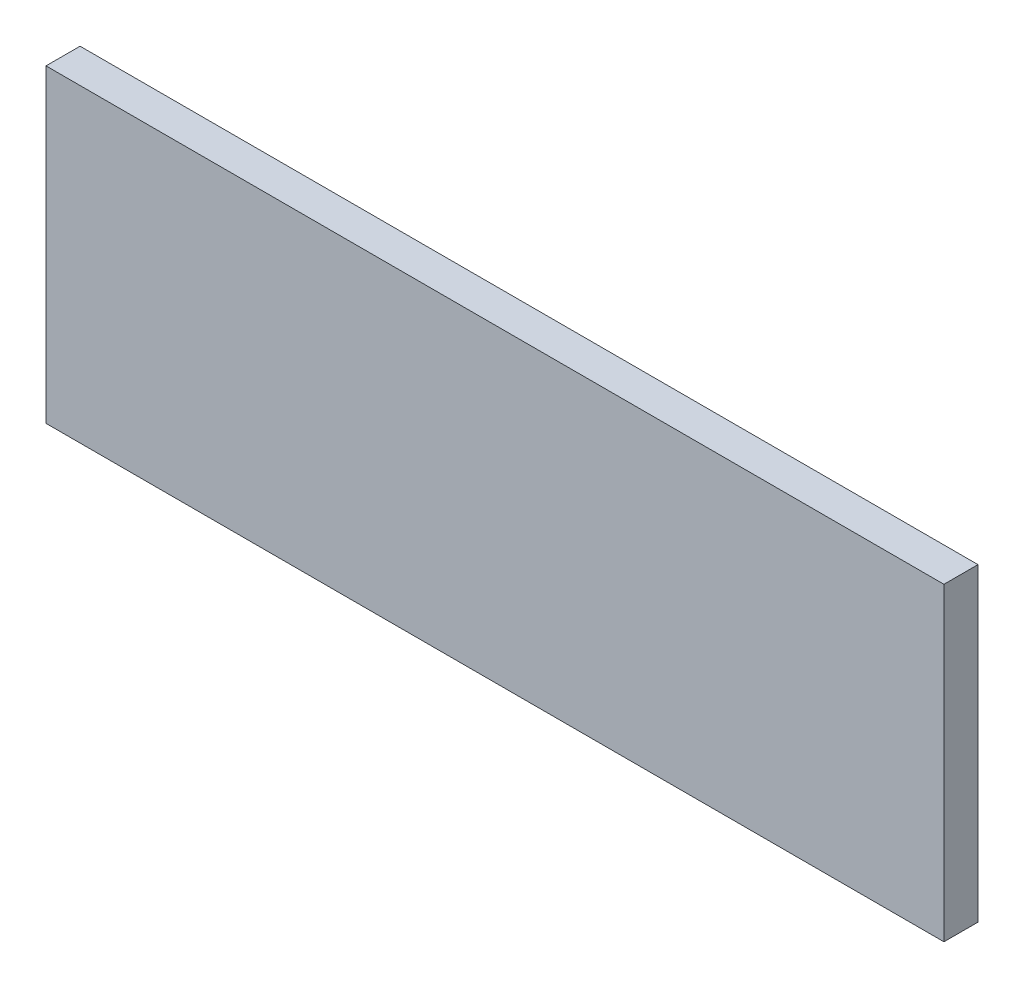
ISO-10303-21;
HEADER;
FILE_DESCRIPTION(('STEP AP214'),'2;1');
FILE_NAME('part.step','',(''),(''),'','','');
FILE_SCHEMA(('AUTOMOTIVE_DESIGN { 1 0 10303 214 1 1 1 1 }'));
ENDSEC;
DATA;
#1=APPLICATION_CONTEXT('core data for automotive mechanical design processes');
#2=APPLICATION_PROTOCOL_DEFINITION('international standard','automotive_design',2000,#1);
#3=PRODUCT_CONTEXT('',#1,'mechanical');
#4=PRODUCT('Part','Part','',(#3));
#5=PRODUCT_RELATED_PRODUCT_CATEGORY('part','',(#4));
#6=PRODUCT_DEFINITION_FORMATION('','',#4);
#7=PRODUCT_DEFINITION_CONTEXT('part definition',#1,'design');
#8=PRODUCT_DEFINITION('design','',#6,#7);
#9=PRODUCT_DEFINITION_SHAPE('','',#8);
#10=(LENGTH_UNIT() NAMED_UNIT(*) SI_UNIT(.MILLI.,.METRE.));
#11=(NAMED_UNIT(*) PLANE_ANGLE_UNIT() SI_UNIT($,.RADIAN.));
#12=(NAMED_UNIT(*) SI_UNIT($,.STERADIAN.) SOLID_ANGLE_UNIT());
#13=UNCERTAINTY_MEASURE_WITH_UNIT(LENGTH_MEASURE(1.E-05),#10,'distance_accuracy_value','');
#14=(GEOMETRIC_REPRESENTATION_CONTEXT(3) GLOBAL_UNCERTAINTY_ASSIGNED_CONTEXT((#13)) GLOBAL_UNIT_ASSIGNED_CONTEXT((#10,
#11,#12)) REPRESENTATION_CONTEXT('',''));
#15=CARTESIAN_POINT('',(0.,0.,0.));
#16=DIRECTION('',(0.,0.,1.));
#17=DIRECTION('',(1.,0.,0.));
#18=AXIS2_PLACEMENT_3D('',#15,#16,#17);
#19=CARTESIAN_POINT('',(290.,-100.,22.));
#20=DIRECTION('',(-1.,0.,0.));
#21=DIRECTION('',(0.,0.,1.));
#22=AXIS2_PLACEMENT_3D('',#19,#20,#21);
#23=PLANE('',#22);
#24=DIRECTION('',(0.,1.,0.));
#25=VECTOR('',#24,1.);
#26=CARTESIAN_POINT('',(290.,-100.,0.));
#27=LINE('',#26,#25);
#28=CARTESIAN_POINT('',(290.,-100.,0.));
#29=VERTEX_POINT('',#28);
#30=CARTESIAN_POINT('',(290.,100.,0.));
#31=VERTEX_POINT('',#30);
#32=EDGE_CURVE('E96',#29,#31,#27,.T.);
#33=ORIENTED_EDGE('',*,*,#32,.T.);
#34=DIRECTION('',(0.,0.,-1.));
#35=VECTOR('',#34,1.);
#36=CARTESIAN_POINT('',(290.,100.,22.));
#37=LINE('',#36,#35);
#38=CARTESIAN_POINT('',(290.,100.,22.));
#39=VERTEX_POINT('',#38);
#40=EDGE_CURVE('E11',#39,#31,#37,.T.);
#41=ORIENTED_EDGE('',*,*,#40,.F.);
#42=DIRECTION('',(0.,1.,0.));
#43=VECTOR('',#42,1.);
#44=CARTESIAN_POINT('',(290.,-100.,22.));
#45=LINE('',#44,#43);
#46=CARTESIAN_POINT('',(290.,-100.,22.));
#47=VERTEX_POINT('',#46);
#48=EDGE_CURVE('E84',#47,#39,#45,.T.);
#49=ORIENTED_EDGE('',*,*,#48,.F.);
#50=DIRECTION('',(0.,0.,-1.));
#51=VECTOR('',#50,1.);
#52=CARTESIAN_POINT('',(290.,-100.,22.));
#53=LINE('',#52,#51);
#54=EDGE_CURVE('E92',#47,#29,#53,.T.);
#55=ORIENTED_EDGE('',*,*,#54,.T.);
#56=EDGE_LOOP('',(#33,#41,#49,#55));
#57=FACE_BOUND('',#56,.T.);
#58=ADVANCED_FACE('F33',(#57),#23,.F.);
#59=CARTESIAN_POINT('',(-290.,100.,22.));
#60=DIRECTION('',(0.,-1.,0.));
#61=DIRECTION('',(0.,0.,-1.));
#62=AXIS2_PLACEMENT_3D('',#59,#60,#61);
#63=PLANE('',#62);
#64=DIRECTION('',(-1.,0.,0.));
#65=VECTOR('',#64,1.);
#66=CARTESIAN_POINT('',(-290.,100.,0.));
#67=LINE('',#66,#65);
#68=CARTESIAN_POINT('',(-290.,100.,0.));
#69=VERTEX_POINT('',#68);
#70=EDGE_CURVE('E88',#31,#69,#67,.T.);
#71=ORIENTED_EDGE('',*,*,#70,.T.);
#72=DIRECTION('',(0.,0.,-1.));
#73=VECTOR('',#72,1.);
#74=CARTESIAN_POINT('',(-290.,100.,22.));
#75=LINE('',#74,#73);
#76=CARTESIAN_POINT('',(-290.,100.,22.));
#77=VERTEX_POINT('',#76);
#78=EDGE_CURVE('E41',#77,#69,#75,.T.);
#79=ORIENTED_EDGE('',*,*,#78,.F.);
#80=DIRECTION('',(-1.,0.,0.));
#81=VECTOR('',#80,1.);
#82=CARTESIAN_POINT('',(-290.,100.,22.));
#83=LINE('',#82,#81);
#84=EDGE_CURVE('E79',#39,#77,#83,.T.);
#85=ORIENTED_EDGE('',*,*,#84,.F.);
#86=ORIENTED_EDGE('',*,*,#40,.T.);
#87=EDGE_LOOP('',(#71,#79,#85,#86));
#88=FACE_BOUND('',#87,.T.);
#89=ADVANCED_FACE('F87',(#88),#63,.F.);
#90=CARTESIAN_POINT('',(-290.,-100.,22.));
#91=DIRECTION('',(1.,0.,0.));
#92=DIRECTION('',(0.,0.,-1.));
#93=AXIS2_PLACEMENT_3D('',#90,#91,#92);
#94=PLANE('',#93);
#95=DIRECTION('',(0.,-1.,0.));
#96=VECTOR('',#95,1.);
#97=CARTESIAN_POINT('',(-290.,-100.,0.));
#98=LINE('',#97,#96);
#99=CARTESIAN_POINT('',(-290.,-100.,0.));
#100=VERTEX_POINT('',#99);
#101=EDGE_CURVE('E66',#69,#100,#98,.T.);
#102=ORIENTED_EDGE('',*,*,#101,.T.);
#103=DIRECTION('',(0.,0.,-1.));
#104=VECTOR('',#103,1.);
#105=CARTESIAN_POINT('',(-290.,-100.,22.));
#106=LINE('',#105,#104);
#107=CARTESIAN_POINT('',(-290.,-100.,22.));
#108=VERTEX_POINT('',#107);
#109=EDGE_CURVE('E89',#108,#100,#106,.T.);
#110=ORIENTED_EDGE('',*,*,#109,.F.);
#111=DIRECTION('',(0.,-1.,0.));
#112=VECTOR('',#111,1.);
#113=CARTESIAN_POINT('',(-290.,-100.,22.));
#114=LINE('',#113,#112);
#115=EDGE_CURVE('E82',#77,#108,#114,.T.);
#116=ORIENTED_EDGE('',*,*,#115,.F.);
#117=ORIENTED_EDGE('',*,*,#78,.T.);
#118=EDGE_LOOP('',(#102,#110,#116,#117));
#119=FACE_BOUND('',#118,.T.);
#120=ADVANCED_FACE('F90',(#119),#94,.F.);
#121=CARTESIAN_POINT('',(-290.,-100.,22.));
#122=DIRECTION('',(0.,1.,0.));
#123=DIRECTION('',(0.,0.,1.));
#124=AXIS2_PLACEMENT_3D('',#121,#122,#123);
#125=PLANE('',#124);
#126=DIRECTION('',(1.,0.,0.));
#127=VECTOR('',#126,1.);
#128=CARTESIAN_POINT('',(-290.,-100.,0.));
#129=LINE('',#128,#127);
#130=EDGE_CURVE('E72',#100,#29,#129,.T.);
#131=ORIENTED_EDGE('',*,*,#130,.T.);
#132=ORIENTED_EDGE('',*,*,#54,.F.);
#133=DIRECTION('',(1.,0.,0.));
#134=VECTOR('',#133,1.);
#135=CARTESIAN_POINT('',(-290.,-100.,22.));
#136=LINE('',#135,#134);
#137=EDGE_CURVE('E49',#108,#47,#136,.T.);
#138=ORIENTED_EDGE('',*,*,#137,.F.);
#139=ORIENTED_EDGE('',*,*,#109,.T.);
#140=EDGE_LOOP('',(#131,#132,#138,#139));
#141=FACE_BOUND('',#140,.T.);
#142=ADVANCED_FACE('F103',(#141),#125,.F.);
#143=CARTESIAN_POINT('',(0.,0.,22.));
#144=DIRECTION('',(0.,0.,-1.));
#145=DIRECTION('',(-1.,0.,0.));
#146=AXIS2_PLACEMENT_3D('',#143,#144,#145);
#147=PLANE('',#146);
#148=ORIENTED_EDGE('',*,*,#48,.T.);
#149=ORIENTED_EDGE('',*,*,#84,.T.);
#150=ORIENTED_EDGE('',*,*,#115,.T.);
#151=ORIENTED_EDGE('',*,*,#137,.T.);
#152=EDGE_LOOP('',(#148,#149,#150,#151));
#153=FACE_BOUND('',#152,.T.);
#154=ADVANCED_FACE('F80',(#153),#147,.F.);
#155=CARTESIAN_POINT('',(0.,0.,0.));
#156=DIRECTION('',(0.,0.,-1.));
#157=DIRECTION('',(-1.,0.,0.));
#158=AXIS2_PLACEMENT_3D('',#155,#156,#157);
#159=PLANE('',#158);
#160=ORIENTED_EDGE('',*,*,#32,.F.);
#161=ORIENTED_EDGE('',*,*,#130,.F.);
#162=ORIENTED_EDGE('',*,*,#101,.F.);
#163=ORIENTED_EDGE('',*,*,#70,.F.);
#164=EDGE_LOOP('',(#160,#161,#162,#163));
#165=FACE_BOUND('',#164,.T.);
#166=ADVANCED_FACE('F106',(#165),#159,.T.);
#167=CLOSED_SHELL('',(#58,#89,#120,#142,#154,#166));
#168=MANIFOLD_SOLID_BREP('B2',#167);
#169=ADVANCED_BREP_SHAPE_REPRESENTATION('',(#18,#168),#14);
#170=SHAPE_DEFINITION_REPRESENTATION(#9,#169);
ENDSEC;
END-ISO-10303-21;
